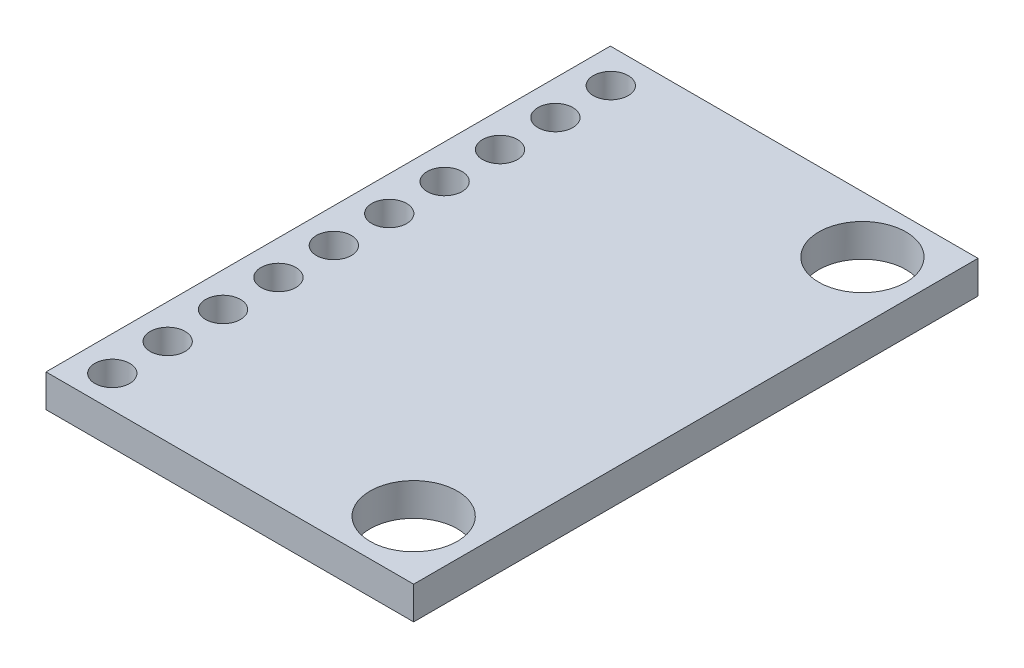
ISO-10303-21;
HEADER;
FILE_DESCRIPTION(('STEP AP214'),'2;1');
FILE_NAME('part.step','',(''),(''),'','','');
FILE_SCHEMA(('AUTOMOTIVE_DESIGN { 1 0 10303 214 1 1 1 1 }'));
ENDSEC;
DATA;
#1=APPLICATION_CONTEXT('core data for automotive mechanical design processes');
#2=APPLICATION_PROTOCOL_DEFINITION('international standard','automotive_design',2000,#1);
#3=PRODUCT_CONTEXT('',#1,'mechanical');
#4=PRODUCT('Part','Part','',(#3));
#5=PRODUCT_RELATED_PRODUCT_CATEGORY('part','',(#4));
#6=PRODUCT_DEFINITION_FORMATION('','',#4);
#7=PRODUCT_DEFINITION_CONTEXT('part definition',#1,'design');
#8=PRODUCT_DEFINITION('design','',#6,#7);
#9=PRODUCT_DEFINITION_SHAPE('','',#8);
#10=(LENGTH_UNIT() NAMED_UNIT(*) SI_UNIT(.MILLI.,.METRE.));
#11=(NAMED_UNIT(*) PLANE_ANGLE_UNIT() SI_UNIT($,.RADIAN.));
#12=(NAMED_UNIT(*) SI_UNIT($,.STERADIAN.) SOLID_ANGLE_UNIT());
#13=UNCERTAINTY_MEASURE_WITH_UNIT(LENGTH_MEASURE(1.E-05),#10,'distance_accuracy_value','');
#14=(GEOMETRIC_REPRESENTATION_CONTEXT(3) GLOBAL_UNCERTAINTY_ASSIGNED_CONTEXT((#13)) GLOBAL_UNIT_ASSIGNED_CONTEXT((#10,
#11,#12)) REPRESENTATION_CONTEXT('',''));
#15=CARTESIAN_POINT('',(0.,0.,0.));
#16=DIRECTION('',(0.,0.,1.));
#17=DIRECTION('',(1.,0.,0.));
#18=AXIS2_PLACEMENT_3D('',#15,#16,#17);
#19=CARTESIAN_POINT('',(0.,1.5,0.));
#20=DIRECTION('',(1.,0.,0.));
#21=DIRECTION('',(0.,0.,-1.));
#22=AXIS2_PLACEMENT_3D('',#19,#20,#21);
#23=PLANE('',#22);
#24=DIRECTION('',(0.,0.,1.));
#25=VECTOR('',#24,1.);
#26=CARTESIAN_POINT('',(0.,0.,0.));
#27=LINE('',#26,#25);
#28=CARTESIAN_POINT('',(0.,0.,-25.88));
#29=VERTEX_POINT('',#28);
#30=CARTESIAN_POINT('',(0.,0.,0.));
#31=VERTEX_POINT('',#30);
#32=EDGE_CURVE('E98',#29,#31,#27,.T.);
#33=ORIENTED_EDGE('',*,*,#32,.T.);
#34=DIRECTION('',(0.,-1.,0.));
#35=VECTOR('',#34,1.);
#36=CARTESIAN_POINT('',(0.,1.5,0.));
#37=LINE('',#36,#35);
#38=CARTESIAN_POINT('',(0.,1.5,0.));
#39=VERTEX_POINT('',#38);
#40=EDGE_CURVE('E11',#39,#31,#37,.T.);
#41=ORIENTED_EDGE('',*,*,#40,.F.);
#42=DIRECTION('',(0.,0.,1.));
#43=VECTOR('',#42,1.);
#44=CARTESIAN_POINT('',(0.,1.5,0.));
#45=LINE('',#44,#43);
#46=CARTESIAN_POINT('',(0.,1.5,-25.88));
#47=VERTEX_POINT('',#46);
#48=EDGE_CURVE('E86',#47,#39,#45,.T.);
#49=ORIENTED_EDGE('',*,*,#48,.F.);
#50=DIRECTION('',(0.,-1.,0.));
#51=VECTOR('',#50,1.);
#52=CARTESIAN_POINT('',(0.,1.5,-25.88));
#53=LINE('',#52,#51);
#54=EDGE_CURVE('E94',#47,#29,#53,.T.);
#55=ORIENTED_EDGE('',*,*,#54,.T.);
#56=EDGE_LOOP('',(#33,#41,#49,#55));
#57=FACE_BOUND('',#56,.T.);
#58=ADVANCED_FACE('F35',(#57),#23,.F.);
#59=CARTESIAN_POINT('',(0.,1.5,0.));
#60=DIRECTION('',(0.,0.,-1.));
#61=DIRECTION('',(-1.,0.,0.));
#62=AXIS2_PLACEMENT_3D('',#59,#60,#61);
#63=PLANE('',#62);
#64=DIRECTION('',(1.,0.,0.));
#65=VECTOR('',#64,1.);
#66=CARTESIAN_POINT('',(0.,0.,0.));
#67=LINE('',#66,#65);
#68=CARTESIAN_POINT('',(16.86,0.,0.));
#69=VERTEX_POINT('',#68);
#70=EDGE_CURVE('E90',#31,#69,#67,.T.);
#71=ORIENTED_EDGE('',*,*,#70,.T.);
#72=DIRECTION('',(0.,-1.,0.));
#73=VECTOR('',#72,1.);
#74=CARTESIAN_POINT('',(16.86,1.5,0.));
#75=LINE('',#74,#73);
#76=CARTESIAN_POINT('',(16.86,1.5,0.));
#77=VERTEX_POINT('',#76);
#78=EDGE_CURVE('E43',#77,#69,#75,.T.);
#79=ORIENTED_EDGE('',*,*,#78,.F.);
#80=DIRECTION('',(1.,0.,0.));
#81=VECTOR('',#80,1.);
#82=CARTESIAN_POINT('',(0.,1.5,0.));
#83=LINE('',#82,#81);
#84=EDGE_CURVE('E81',#39,#77,#83,.T.);
#85=ORIENTED_EDGE('',*,*,#84,.F.);
#86=ORIENTED_EDGE('',*,*,#40,.T.);
#87=EDGE_LOOP('',(#71,#79,#85,#86));
#88=FACE_BOUND('',#87,.T.);
#89=ADVANCED_FACE('F89',(#88),#63,.F.);
#90=CARTESIAN_POINT('',(16.86,1.5,0.));
#91=DIRECTION('',(-1.,0.,0.));
#92=DIRECTION('',(0.,0.,1.));
#93=AXIS2_PLACEMENT_3D('',#90,#91,#92);
#94=PLANE('',#93);
#95=DIRECTION('',(0.,0.,-1.));
#96=VECTOR('',#95,1.);
#97=CARTESIAN_POINT('',(16.86,0.,0.));
#98=LINE('',#97,#96);
#99=CARTESIAN_POINT('',(16.86,0.,-25.88));
#100=VERTEX_POINT('',#99);
#101=EDGE_CURVE('E68',#69,#100,#98,.T.);
#102=ORIENTED_EDGE('',*,*,#101,.T.);
#103=DIRECTION('',(0.,-1.,0.));
#104=VECTOR('',#103,1.);
#105=CARTESIAN_POINT('',(16.86,1.5,-25.88));
#106=LINE('',#105,#104);
#107=CARTESIAN_POINT('',(16.86,1.5,-25.88));
#108=VERTEX_POINT('',#107);
#109=EDGE_CURVE('E91',#108,#100,#106,.T.);
#110=ORIENTED_EDGE('',*,*,#109,.F.);
#111=DIRECTION('',(0.,0.,-1.));
#112=VECTOR('',#111,1.);
#113=CARTESIAN_POINT('',(16.86,1.5,0.));
#114=LINE('',#113,#112);
#115=EDGE_CURVE('E84',#77,#108,#114,.T.);
#116=ORIENTED_EDGE('',*,*,#115,.F.);
#117=ORIENTED_EDGE('',*,*,#78,.T.);
#118=EDGE_LOOP('',(#102,#110,#116,#117));
#119=FACE_BOUND('',#118,.T.);
#120=ADVANCED_FACE('F92',(#119),#94,.F.);
#121=CARTESIAN_POINT('',(0.,1.5,-25.88));
#122=DIRECTION('',(0.,0.,1.));
#123=DIRECTION('',(1.,0.,0.));
#124=AXIS2_PLACEMENT_3D('',#121,#122,#123);
#125=PLANE('',#124);
#126=DIRECTION('',(-1.,0.,0.));
#127=VECTOR('',#126,1.);
#128=CARTESIAN_POINT('',(0.,0.,-25.88));
#129=LINE('',#128,#127);
#130=EDGE_CURVE('E74',#100,#29,#129,.T.);
#131=ORIENTED_EDGE('',*,*,#130,.T.);
#132=ORIENTED_EDGE('',*,*,#54,.F.);
#133=DIRECTION('',(-1.,0.,0.));
#134=VECTOR('',#133,1.);
#135=CARTESIAN_POINT('',(0.,1.5,-25.88));
#136=LINE('',#135,#134);
#137=EDGE_CURVE('E51',#108,#47,#136,.T.);
#138=ORIENTED_EDGE('',*,*,#137,.F.);
#139=ORIENTED_EDGE('',*,*,#109,.T.);
#140=EDGE_LOOP('',(#131,#132,#138,#139));
#141=FACE_BOUND('',#140,.T.);
#142=ADVANCED_FACE('F106',(#141),#125,.F.);
#143=CARTESIAN_POINT('',(0.,1.5,0.));
#144=DIRECTION('',(0.,-1.,0.));
#145=DIRECTION('',(0.,0.,-1.));
#146=AXIS2_PLACEMENT_3D('',#143,#144,#145);
#147=PLANE('',#146);
#148=CARTESIAN_POINT('',(1.58,1.5,-1.46));
#149=DIRECTION('',(0.,1.,0.));
#150=DIRECTION('',(0.,0.,1.));
#151=AXIS2_PLACEMENT_3D('',#148,#149,#150);
#152=CIRCLE('',#151,0.799999999999998);
#153=CARTESIAN_POINT('',(1.58,1.5,-0.660000000000001));
#154=VERTEX_POINT('',#153);
#155=EDGE_CURVE('E175',#154,#154,#152,.T.);
#156=ORIENTED_EDGE('',*,*,#155,.F.);
#157=EDGE_LOOP('',(#156));
#158=FACE_BOUND('',#157,.T.);
#159=CARTESIAN_POINT('',(1.58,1.5,-4.));
#160=DIRECTION('',(0.,1.,0.));
#161=DIRECTION('',(0.,0.,1.));
#162=AXIS2_PLACEMENT_3D('',#159,#160,#161);
#163=CIRCLE('',#162,0.799999999999998);
#164=CARTESIAN_POINT('',(1.58,1.5,-3.2));
#165=VERTEX_POINT('',#164);
#166=EDGE_CURVE('E169',#165,#165,#163,.T.);
#167=ORIENTED_EDGE('',*,*,#166,.F.);
#168=EDGE_LOOP('',(#167));
#169=FACE_BOUND('',#168,.T.);
#170=CARTESIAN_POINT('',(1.58,1.5,-6.54));
#171=DIRECTION('',(0.,1.,0.));
#172=DIRECTION('',(0.,0.,1.));
#173=AXIS2_PLACEMENT_3D('',#170,#171,#172);
#174=CIRCLE('',#173,0.799999999999998);
#175=CARTESIAN_POINT('',(1.58,1.5,-5.74));
#176=VERTEX_POINT('',#175);
#177=EDGE_CURVE('E163',#176,#176,#174,.T.);
#178=ORIENTED_EDGE('',*,*,#177,.F.);
#179=EDGE_LOOP('',(#178));
#180=FACE_BOUND('',#179,.T.);
#181=CARTESIAN_POINT('',(1.58,1.5,-9.08));
#182=DIRECTION('',(0.,1.,0.));
#183=DIRECTION('',(0.,0.,1.));
#184=AXIS2_PLACEMENT_3D('',#181,#182,#183);
#185=CIRCLE('',#184,0.799999999999998);
#186=CARTESIAN_POINT('',(1.58,1.5,-8.28));
#187=VERTEX_POINT('',#186);
#188=EDGE_CURVE('E157',#187,#187,#185,.T.);
#189=ORIENTED_EDGE('',*,*,#188,.F.);
#190=EDGE_LOOP('',(#189));
#191=FACE_BOUND('',#190,.T.);
#192=CARTESIAN_POINT('',(1.58,1.5,-11.62));
#193=DIRECTION('',(0.,1.,0.));
#194=DIRECTION('',(0.,0.,1.));
#195=AXIS2_PLACEMENT_3D('',#192,#193,#194);
#196=CIRCLE('',#195,0.799999999999998);
#197=CARTESIAN_POINT('',(1.58,1.5,-10.82));
#198=VERTEX_POINT('',#197);
#199=EDGE_CURVE('E151',#198,#198,#196,.T.);
#200=ORIENTED_EDGE('',*,*,#199,.F.);
#201=EDGE_LOOP('',(#200));
#202=FACE_BOUND('',#201,.T.);
#203=CARTESIAN_POINT('',(1.58,1.5,-14.16));
#204=DIRECTION('',(0.,1.,0.));
#205=DIRECTION('',(0.,0.,1.));
#206=AXIS2_PLACEMENT_3D('',#203,#204,#205);
#207=CIRCLE('',#206,0.799999999999998);
#208=CARTESIAN_POINT('',(1.58,1.5,-13.36));
#209=VERTEX_POINT('',#208);
#210=EDGE_CURVE('E145',#209,#209,#207,.T.);
#211=ORIENTED_EDGE('',*,*,#210,.F.);
#212=EDGE_LOOP('',(#211));
#213=FACE_BOUND('',#212,.T.);
#214=CARTESIAN_POINT('',(1.58,1.5,-16.7));
#215=DIRECTION('',(0.,1.,0.));
#216=DIRECTION('',(0.,0.,1.));
#217=AXIS2_PLACEMENT_3D('',#214,#215,#216);
#218=CIRCLE('',#217,0.799999999999999);
#219=CARTESIAN_POINT('',(1.58,1.5,-15.9));
#220=VERTEX_POINT('',#219);
#221=EDGE_CURVE('E139',#220,#220,#218,.T.);
#222=ORIENTED_EDGE('',*,*,#221,.F.);
#223=EDGE_LOOP('',(#222));
#224=FACE_BOUND('',#223,.T.);
#225=CARTESIAN_POINT('',(1.58,1.5,-19.24));
#226=DIRECTION('',(0.,1.,0.));
#227=DIRECTION('',(0.,0.,1.));
#228=AXIS2_PLACEMENT_3D('',#225,#226,#227);
#229=CIRCLE('',#228,0.799999999999998);
#230=CARTESIAN_POINT('',(1.58,1.5,-18.44));
#231=VERTEX_POINT('',#230);
#232=EDGE_CURVE('E133',#231,#231,#229,.T.);
#233=ORIENTED_EDGE('',*,*,#232,.F.);
#234=EDGE_LOOP('',(#233));
#235=FACE_BOUND('',#234,.T.);
#236=CARTESIAN_POINT('',(1.58,1.5,-21.78));
#237=DIRECTION('',(0.,1.,0.));
#238=DIRECTION('',(0.,0.,1.));
#239=AXIS2_PLACEMENT_3D('',#236,#237,#238);
#240=CIRCLE('',#239,0.799999999999998);
#241=CARTESIAN_POINT('',(1.58,1.5,-20.98));
#242=VERTEX_POINT('',#241);
#243=EDGE_CURVE('E127',#242,#242,#240,.T.);
#244=ORIENTED_EDGE('',*,*,#243,.F.);
#245=EDGE_LOOP('',(#244));
#246=FACE_BOUND('',#245,.T.);
#247=CARTESIAN_POINT('',(1.58,1.5,-24.32));
#248=DIRECTION('',(0.,1.,0.));
#249=DIRECTION('',(0.,0.,1.));
#250=AXIS2_PLACEMENT_3D('',#247,#248,#249);
#251=CIRCLE('',#250,0.799999999999998);
#252=CARTESIAN_POINT('',(1.58,1.5,-23.52));
#253=VERTEX_POINT('',#252);
#254=EDGE_CURVE('E121',#253,#253,#251,.T.);
#255=ORIENTED_EDGE('',*,*,#254,.F.);
#256=EDGE_LOOP('',(#255));
#257=FACE_BOUND('',#256,.T.);
#258=CARTESIAN_POINT('',(14.16,1.5,-2.7));
#259=DIRECTION('',(0.,1.,0.));
#260=DIRECTION('',(0.,0.,1.));
#261=AXIS2_PLACEMENT_3D('',#258,#259,#260);
#262=CIRCLE('',#261,2.);
#263=CARTESIAN_POINT('',(14.16,1.5,-0.699999999999997));
#264=VERTEX_POINT('',#263);
#265=EDGE_CURVE('E115',#264,#264,#262,.T.);
#266=ORIENTED_EDGE('',*,*,#265,.F.);
#267=EDGE_LOOP('',(#266));
#268=FACE_BOUND('',#267,.T.);
#269=CARTESIAN_POINT('',(14.16,1.5,-23.28));
#270=DIRECTION('',(0.,1.,0.));
#271=DIRECTION('',(0.,0.,1.));
#272=AXIS2_PLACEMENT_3D('',#269,#270,#271);
#273=CIRCLE('',#272,2.00000000000001);
#274=CARTESIAN_POINT('',(14.16,1.5,-21.28));
#275=VERTEX_POINT('',#274);
#276=EDGE_CURVE('E101',#275,#275,#273,.T.);
#277=ORIENTED_EDGE('',*,*,#276,.F.);
#278=EDGE_LOOP('',(#277));
#279=FACE_BOUND('',#278,.T.);
#280=ORIENTED_EDGE('',*,*,#48,.T.);
#281=ORIENTED_EDGE('',*,*,#84,.T.);
#282=ORIENTED_EDGE('',*,*,#115,.T.);
#283=ORIENTED_EDGE('',*,*,#137,.T.);
#284=EDGE_LOOP('',(#280,#281,#282,#283));
#285=FACE_BOUND('',#284,.T.);
#286=ADVANCED_FACE('F82',(#158,#169,#180,#191,#202,#213,#224,#235,#246,#257,#268,#279,#285),
#147,.F.);
#287=CARTESIAN_POINT('',(0.,0.,0.));
#288=DIRECTION('',(0.,-1.,0.));
#289=DIRECTION('',(0.,0.,-1.));
#290=AXIS2_PLACEMENT_3D('',#287,#288,#289);
#291=PLANE('',#290);
#292=CARTESIAN_POINT('',(1.58,0.,-1.46));
#293=DIRECTION('',(0.,-1.,0.));
#294=DIRECTION('',(0.,0.,-1.));
#295=AXIS2_PLACEMENT_3D('',#292,#293,#294);
#296=CIRCLE('',#295,0.799999999999998);
#297=CARTESIAN_POINT('',(1.58,0.,-2.26));
#298=VERTEX_POINT('',#297);
#299=EDGE_CURVE('E178',#298,#298,#296,.F.);
#300=ORIENTED_EDGE('',*,*,#299,.T.);
#301=EDGE_LOOP('',(#300));
#302=FACE_BOUND('',#301,.T.);
#303=CARTESIAN_POINT('',(1.58,0.,-4.));
#304=DIRECTION('',(0.,-1.,0.));
#305=DIRECTION('',(0.,0.,-1.));
#306=AXIS2_PLACEMENT_3D('',#303,#304,#305);
#307=CIRCLE('',#306,0.799999999999998);
#308=CARTESIAN_POINT('',(1.58,0.,-4.8));
#309=VERTEX_POINT('',#308);
#310=EDGE_CURVE('E172',#309,#309,#307,.F.);
#311=ORIENTED_EDGE('',*,*,#310,.T.);
#312=EDGE_LOOP('',(#311));
#313=FACE_BOUND('',#312,.T.);
#314=CARTESIAN_POINT('',(1.58,0.,-6.54));
#315=DIRECTION('',(0.,-1.,0.));
#316=DIRECTION('',(0.,0.,-1.));
#317=AXIS2_PLACEMENT_3D('',#314,#315,#316);
#318=CIRCLE('',#317,0.799999999999998);
#319=CARTESIAN_POINT('',(1.58,0.,-7.34));
#320=VERTEX_POINT('',#319);
#321=EDGE_CURVE('E166',#320,#320,#318,.F.);
#322=ORIENTED_EDGE('',*,*,#321,.T.);
#323=EDGE_LOOP('',(#322));
#324=FACE_BOUND('',#323,.T.);
#325=CARTESIAN_POINT('',(1.58,0.,-9.08));
#326=DIRECTION('',(0.,-1.,0.));
#327=DIRECTION('',(0.,0.,-1.));
#328=AXIS2_PLACEMENT_3D('',#325,#326,#327);
#329=CIRCLE('',#328,0.799999999999998);
#330=CARTESIAN_POINT('',(1.58,0.,-9.88));
#331=VERTEX_POINT('',#330);
#332=EDGE_CURVE('E160',#331,#331,#329,.F.);
#333=ORIENTED_EDGE('',*,*,#332,.T.);
#334=EDGE_LOOP('',(#333));
#335=FACE_BOUND('',#334,.T.);
#336=CARTESIAN_POINT('',(1.58,0.,-11.62));
#337=DIRECTION('',(0.,-1.,0.));
#338=DIRECTION('',(0.,0.,-1.));
#339=AXIS2_PLACEMENT_3D('',#336,#337,#338);
#340=CIRCLE('',#339,0.799999999999998);
#341=CARTESIAN_POINT('',(1.58,0.,-12.42));
#342=VERTEX_POINT('',#341);
#343=EDGE_CURVE('E154',#342,#342,#340,.F.);
#344=ORIENTED_EDGE('',*,*,#343,.T.);
#345=EDGE_LOOP('',(#344));
#346=FACE_BOUND('',#345,.T.);
#347=CARTESIAN_POINT('',(1.58,0.,-14.16));
#348=DIRECTION('',(0.,-1.,0.));
#349=DIRECTION('',(0.,0.,-1.));
#350=AXIS2_PLACEMENT_3D('',#347,#348,#349);
#351=CIRCLE('',#350,0.799999999999998);
#352=CARTESIAN_POINT('',(1.58,0.,-14.96));
#353=VERTEX_POINT('',#352);
#354=EDGE_CURVE('E148',#353,#353,#351,.F.);
#355=ORIENTED_EDGE('',*,*,#354,.T.);
#356=EDGE_LOOP('',(#355));
#357=FACE_BOUND('',#356,.T.);
#358=CARTESIAN_POINT('',(1.58,0.,-16.7));
#359=DIRECTION('',(0.,-1.,0.));
#360=DIRECTION('',(0.,0.,-1.));
#361=AXIS2_PLACEMENT_3D('',#358,#359,#360);
#362=CIRCLE('',#361,0.799999999999999);
#363=CARTESIAN_POINT('',(1.58,0.,-17.5));
#364=VERTEX_POINT('',#363);
#365=EDGE_CURVE('E142',#364,#364,#362,.F.);
#366=ORIENTED_EDGE('',*,*,#365,.T.);
#367=EDGE_LOOP('',(#366));
#368=FACE_BOUND('',#367,.T.);
#369=CARTESIAN_POINT('',(1.58,0.,-19.24));
#370=DIRECTION('',(0.,-1.,0.));
#371=DIRECTION('',(0.,0.,-1.));
#372=AXIS2_PLACEMENT_3D('',#369,#370,#371);
#373=CIRCLE('',#372,0.799999999999998);
#374=CARTESIAN_POINT('',(1.58,0.,-20.04));
#375=VERTEX_POINT('',#374);
#376=EDGE_CURVE('E136',#375,#375,#373,.F.);
#377=ORIENTED_EDGE('',*,*,#376,.T.);
#378=EDGE_LOOP('',(#377));
#379=FACE_BOUND('',#378,.T.);
#380=CARTESIAN_POINT('',(1.58,0.,-21.78));
#381=DIRECTION('',(0.,-1.,0.));
#382=DIRECTION('',(0.,0.,-1.));
#383=AXIS2_PLACEMENT_3D('',#380,#381,#382);
#384=CIRCLE('',#383,0.799999999999998);
#385=CARTESIAN_POINT('',(1.58,0.,-22.58));
#386=VERTEX_POINT('',#385);
#387=EDGE_CURVE('E130',#386,#386,#384,.F.);
#388=ORIENTED_EDGE('',*,*,#387,.T.);
#389=EDGE_LOOP('',(#388));
#390=FACE_BOUND('',#389,.T.);
#391=CARTESIAN_POINT('',(1.58,0.,-24.32));
#392=DIRECTION('',(0.,-1.,0.));
#393=DIRECTION('',(0.,0.,-1.));
#394=AXIS2_PLACEMENT_3D('',#391,#392,#393);
#395=CIRCLE('',#394,0.799999999999998);
#396=CARTESIAN_POINT('',(1.58,0.,-25.12));
#397=VERTEX_POINT('',#396);
#398=EDGE_CURVE('E124',#397,#397,#395,.F.);
#399=ORIENTED_EDGE('',*,*,#398,.T.);
#400=EDGE_LOOP('',(#399));
#401=FACE_BOUND('',#400,.T.);
#402=CARTESIAN_POINT('',(14.16,0.,-2.7));
#403=DIRECTION('',(0.,-1.,0.));
#404=DIRECTION('',(0.,0.,-1.));
#405=AXIS2_PLACEMENT_3D('',#402,#403,#404);
#406=CIRCLE('',#405,2.);
#407=CARTESIAN_POINT('',(14.16,0.,-4.7));
#408=VERTEX_POINT('',#407);
#409=EDGE_CURVE('E118',#408,#408,#406,.F.);
#410=ORIENTED_EDGE('',*,*,#409,.T.);
#411=EDGE_LOOP('',(#410));
#412=FACE_BOUND('',#411,.T.);
#413=CARTESIAN_POINT('',(14.16,0.,-23.28));
#414=DIRECTION('',(0.,-1.,0.));
#415=DIRECTION('',(0.,0.,-1.));
#416=AXIS2_PLACEMENT_3D('',#413,#414,#415);
#417=CIRCLE('',#416,2.00000000000001);
#418=CARTESIAN_POINT('',(14.16,0.,-25.28));
#419=VERTEX_POINT('',#418);
#420=EDGE_CURVE('E112',#419,#419,#417,.F.);
#421=ORIENTED_EDGE('',*,*,#420,.T.);
#422=EDGE_LOOP('',(#421));
#423=FACE_BOUND('',#422,.T.);
#424=ORIENTED_EDGE('',*,*,#32,.F.);
#425=ORIENTED_EDGE('',*,*,#130,.F.);
#426=ORIENTED_EDGE('',*,*,#101,.F.);
#427=ORIENTED_EDGE('',*,*,#70,.F.);
#428=EDGE_LOOP('',(#424,#425,#426,#427));
#429=FACE_BOUND('',#428,.T.);
#430=ADVANCED_FACE('F109',(#302,#313,#324,#335,#346,#357,#368,#379,#390,#401,#412,#423,#429),
#291,.T.);
#431=CARTESIAN_POINT('',(14.16,-0.000999999999999916,-23.28));
#432=DIRECTION('',(0.,1.,0.));
#433=DIRECTION('',(0.,0.,1.));
#434=AXIS2_PLACEMENT_3D('',#431,#432,#433);
#435=CYLINDRICAL_SURFACE('',#434,2.00000000000001);
#436=ORIENTED_EDGE('',*,*,#420,.F.);
#437=EDGE_LOOP('',(#436));
#438=FACE_BOUND('',#437,.T.);
#439=ORIENTED_EDGE('',*,*,#276,.T.);
#440=EDGE_LOOP('',(#439));
#441=FACE_BOUND('',#440,.T.);
#442=ADVANCED_FACE('F211',(#438,#441),#435,.F.);
#443=CARTESIAN_POINT('',(14.16,-0.000999999999999916,-2.7));
#444=DIRECTION('',(0.,1.,0.));
#445=DIRECTION('',(0.,0.,1.));
#446=AXIS2_PLACEMENT_3D('',#443,#444,#445);
#447=CYLINDRICAL_SURFACE('',#446,2.);
#448=ORIENTED_EDGE('',*,*,#409,.F.);
#449=EDGE_LOOP('',(#448));
#450=FACE_BOUND('',#449,.T.);
#451=ORIENTED_EDGE('',*,*,#265,.T.);
#452=EDGE_LOOP('',(#451));
#453=FACE_BOUND('',#452,.T.);
#454=ADVANCED_FACE('F213',(#450,#453),#447,.F.);
#455=CARTESIAN_POINT('',(1.58,-0.000999999999999916,-24.32));
#456=DIRECTION('',(0.,1.,0.));
#457=DIRECTION('',(0.,0.,1.));
#458=AXIS2_PLACEMENT_3D('',#455,#456,#457);
#459=CYLINDRICAL_SURFACE('',#458,0.799999999999998);
#460=ORIENTED_EDGE('',*,*,#398,.F.);
#461=EDGE_LOOP('',(#460));
#462=FACE_BOUND('',#461,.T.);
#463=ORIENTED_EDGE('',*,*,#254,.T.);
#464=EDGE_LOOP('',(#463));
#465=FACE_BOUND('',#464,.T.);
#466=ADVANCED_FACE('F220',(#462,#465),#459,.F.);
#467=CARTESIAN_POINT('',(1.58,-0.000999999999999916,-21.78));
#468=DIRECTION('',(0.,1.,0.));
#469=DIRECTION('',(0.,0.,1.));
#470=AXIS2_PLACEMENT_3D('',#467,#468,#469);
#471=CYLINDRICAL_SURFACE('',#470,0.799999999999998);
#472=ORIENTED_EDGE('',*,*,#387,.F.);
#473=EDGE_LOOP('',(#472));
#474=FACE_BOUND('',#473,.T.);
#475=ORIENTED_EDGE('',*,*,#243,.T.);
#476=EDGE_LOOP('',(#475));
#477=FACE_BOUND('',#476,.T.);
#478=ADVANCED_FACE('F260',(#474,#477),#471,.F.);
#479=CARTESIAN_POINT('',(1.58,-0.000999999999999916,-19.24));
#480=DIRECTION('',(0.,1.,0.));
#481=DIRECTION('',(0.,0.,1.));
#482=AXIS2_PLACEMENT_3D('',#479,#480,#481);
#483=CYLINDRICAL_SURFACE('',#482,0.799999999999998);
#484=ORIENTED_EDGE('',*,*,#376,.F.);
#485=EDGE_LOOP('',(#484));
#486=FACE_BOUND('',#485,.T.);
#487=ORIENTED_EDGE('',*,*,#232,.T.);
#488=EDGE_LOOP('',(#487));
#489=FACE_BOUND('',#488,.T.);
#490=ADVANCED_FACE('F271',(#486,#489),#483,.F.);
#491=CARTESIAN_POINT('',(1.58,-0.000999999999999916,-16.7));
#492=DIRECTION('',(0.,1.,0.));
#493=DIRECTION('',(0.,0.,1.));
#494=AXIS2_PLACEMENT_3D('',#491,#492,#493);
#495=CYLINDRICAL_SURFACE('',#494,0.799999999999999);
#496=ORIENTED_EDGE('',*,*,#365,.F.);
#497=EDGE_LOOP('',(#496));
#498=FACE_BOUND('',#497,.T.);
#499=ORIENTED_EDGE('',*,*,#221,.T.);
#500=EDGE_LOOP('',(#499));
#501=FACE_BOUND('',#500,.T.);
#502=ADVANCED_FACE('F281',(#498,#501),#495,.F.);
#503=CARTESIAN_POINT('',(1.58,-0.000999999999999916,-14.16));
#504=DIRECTION('',(0.,1.,0.));
#505=DIRECTION('',(0.,0.,1.));
#506=AXIS2_PLACEMENT_3D('',#503,#504,#505);
#507=CYLINDRICAL_SURFACE('',#506,0.799999999999998);
#508=ORIENTED_EDGE('',*,*,#354,.F.);
#509=EDGE_LOOP('',(#508));
#510=FACE_BOUND('',#509,.T.);
#511=ORIENTED_EDGE('',*,*,#210,.T.);
#512=EDGE_LOOP('',(#511));
#513=FACE_BOUND('',#512,.T.);
#514=ADVANCED_FACE('F291',(#510,#513),#507,.F.);
#515=CARTESIAN_POINT('',(1.58,-0.000999999999999916,-11.62));
#516=DIRECTION('',(0.,1.,0.));
#517=DIRECTION('',(0.,0.,1.));
#518=AXIS2_PLACEMENT_3D('',#515,#516,#517);
#519=CYLINDRICAL_SURFACE('',#518,0.799999999999998);
#520=ORIENTED_EDGE('',*,*,#343,.F.);
#521=EDGE_LOOP('',(#520));
#522=FACE_BOUND('',#521,.T.);
#523=ORIENTED_EDGE('',*,*,#199,.T.);
#524=EDGE_LOOP('',(#523));
#525=FACE_BOUND('',#524,.T.);
#526=ADVANCED_FACE('F301',(#522,#525),#519,.F.);
#527=CARTESIAN_POINT('',(1.58,-0.000999999999999916,-9.08));
#528=DIRECTION('',(0.,1.,0.));
#529=DIRECTION('',(0.,0.,1.));
#530=AXIS2_PLACEMENT_3D('',#527,#528,#529);
#531=CYLINDRICAL_SURFACE('',#530,0.799999999999998);
#532=ORIENTED_EDGE('',*,*,#332,.F.);
#533=EDGE_LOOP('',(#532));
#534=FACE_BOUND('',#533,.T.);
#535=ORIENTED_EDGE('',*,*,#188,.T.);
#536=EDGE_LOOP('',(#535));
#537=FACE_BOUND('',#536,.T.);
#538=ADVANCED_FACE('F311',(#534,#537),#531,.F.);
#539=CARTESIAN_POINT('',(1.58,-0.000999999999999916,-6.54));
#540=DIRECTION('',(0.,1.,0.));
#541=DIRECTION('',(0.,0.,1.));
#542=AXIS2_PLACEMENT_3D('',#539,#540,#541);
#543=CYLINDRICAL_SURFACE('',#542,0.799999999999998);
#544=ORIENTED_EDGE('',*,*,#321,.F.);
#545=EDGE_LOOP('',(#544));
#546=FACE_BOUND('',#545,.T.);
#547=ORIENTED_EDGE('',*,*,#177,.T.);
#548=EDGE_LOOP('',(#547));
#549=FACE_BOUND('',#548,.T.);
#550=ADVANCED_FACE('F321',(#546,#549),#543,.F.);
#551=CARTESIAN_POINT('',(1.58,-0.000999999999999916,-4.));
#552=DIRECTION('',(0.,1.,0.));
#553=DIRECTION('',(0.,0.,1.));
#554=AXIS2_PLACEMENT_3D('',#551,#552,#553);
#555=CYLINDRICAL_SURFACE('',#554,0.799999999999998);
#556=ORIENTED_EDGE('',*,*,#310,.F.);
#557=EDGE_LOOP('',(#556));
#558=FACE_BOUND('',#557,.T.);
#559=ORIENTED_EDGE('',*,*,#166,.T.);
#560=EDGE_LOOP('',(#559));
#561=FACE_BOUND('',#560,.T.);
#562=ADVANCED_FACE('F331',(#558,#561),#555,.F.);
#563=CARTESIAN_POINT('',(1.58,-0.000999999999999916,-1.46));
#564=DIRECTION('',(0.,1.,0.));
#565=DIRECTION('',(0.,0.,1.));
#566=AXIS2_PLACEMENT_3D('',#563,#564,#565);
#567=CYLINDRICAL_SURFACE('',#566,0.799999999999998);
#568=ORIENTED_EDGE('',*,*,#299,.F.);
#569=EDGE_LOOP('',(#568));
#570=FACE_BOUND('',#569,.T.);
#571=ORIENTED_EDGE('',*,*,#155,.T.);
#572=EDGE_LOOP('',(#571));
#573=FACE_BOUND('',#572,.T.);
#574=ADVANCED_FACE('F184',(#570,#573),#567,.F.);
#575=CLOSED_SHELL('',(#58,#89,#120,#142,#286,#430,#442,#454,#466,#478,#490,#502,#514,#526,#538,
#550,#562,#574));
#576=MANIFOLD_SOLID_BREP('B2',#575);
#577=ADVANCED_BREP_SHAPE_REPRESENTATION('',(#18,#576),#14);
#578=SHAPE_DEFINITION_REPRESENTATION(#9,#577);
ENDSEC;
END-ISO-10303-21;
